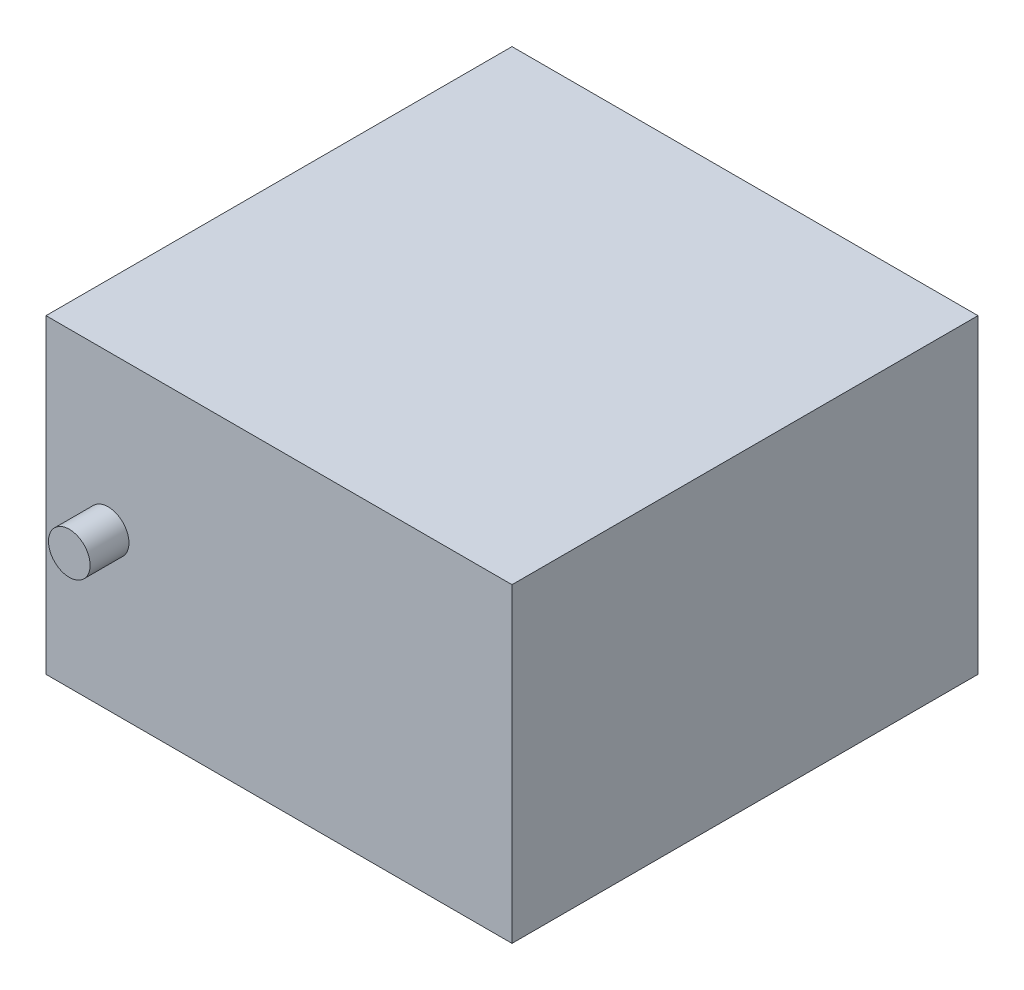
ISO-10303-21;
HEADER;
FILE_DESCRIPTION(('STEP AP214'),'2;1');
FILE_NAME('part.step','',(''),(''),'','','');
FILE_SCHEMA(('AUTOMOTIVE_DESIGN { 1 0 10303 214 1 1 1 1 }'));
ENDSEC;
DATA;
#1=APPLICATION_CONTEXT('core data for automotive mechanical design processes');
#2=APPLICATION_PROTOCOL_DEFINITION('international standard','automotive_design',2000,#1);
#3=PRODUCT_CONTEXT('',#1,'mechanical');
#4=PRODUCT('Part','Part','',(#3));
#5=PRODUCT_RELATED_PRODUCT_CATEGORY('part','',(#4));
#6=PRODUCT_DEFINITION_FORMATION('','',#4);
#7=PRODUCT_DEFINITION_CONTEXT('part definition',#1,'design');
#8=PRODUCT_DEFINITION('design','',#6,#7);
#9=PRODUCT_DEFINITION_SHAPE('','',#8);
#10=(LENGTH_UNIT() NAMED_UNIT(*) SI_UNIT(.MILLI.,.METRE.));
#11=(NAMED_UNIT(*) PLANE_ANGLE_UNIT() SI_UNIT($,.RADIAN.));
#12=(NAMED_UNIT(*) SI_UNIT($,.STERADIAN.) SOLID_ANGLE_UNIT());
#13=UNCERTAINTY_MEASURE_WITH_UNIT(LENGTH_MEASURE(1.E-05),#10,'distance_accuracy_value','');
#14=(GEOMETRIC_REPRESENTATION_CONTEXT(3) GLOBAL_UNCERTAINTY_ASSIGNED_CONTEXT((#13)) GLOBAL_UNIT_ASSIGNED_CONTEXT((#10,
#11,#12)) REPRESENTATION_CONTEXT('',''));
#15=CARTESIAN_POINT('',(0.,0.,0.));
#16=DIRECTION('',(0.,0.,1.));
#17=DIRECTION('',(1.,0.,0.));
#18=AXIS2_PLACEMENT_3D('',#15,#16,#17);
#19=CARTESIAN_POINT('',(-32.3188405797101,20.8695652173913,40.));
#20=DIRECTION('',(1.,0.,0.));
#21=DIRECTION('',(0.,1.,0.));
#22=AXIS2_PLACEMENT_3D('',#19,#20,#21);
#23=PLANE('',#22);
#24=DIRECTION('',(0.,0.,-1.));
#25=VECTOR('',#24,1.);
#26=CARTESIAN_POINT('',(-32.3188405797101,20.8695652173913,40.));
#27=LINE('',#26,#25);
#28=CARTESIAN_POINT('',(-32.3188405797101,20.8695652173913,40.));
#29=VERTEX_POINT('',#28);
#30=CARTESIAN_POINT('',(-32.3188405797101,20.8695652173913,10.));
#31=VERTEX_POINT('',#30);
#32=EDGE_CURVE('E46',#29,#31,#27,.T.);
#33=ORIENTED_EDGE('',*,*,#32,.T.);
#34=DIRECTION('',(0.,-1.,0.));
#35=VECTOR('',#34,1.);
#36=CARTESIAN_POINT('',(-32.3188405797102,20.8695652173913,10.));
#37=LINE('',#36,#35);
#38=CARTESIAN_POINT('',(-32.3188405797102,0.869565217391302,10.));
#39=VERTEX_POINT('',#38);
#40=EDGE_CURVE('E112',#31,#39,#37,.T.);
#41=ORIENTED_EDGE('',*,*,#40,.T.);
#42=DIRECTION('',(0.,0.,-1.));
#43=VECTOR('',#42,1.);
#44=CARTESIAN_POINT('',(-32.3188405797102,0.869565217391302,40.));
#45=LINE('',#44,#43);
#46=CARTESIAN_POINT('',(-32.3188405797102,0.869565217391302,40.));
#47=VERTEX_POINT('',#46);
#48=EDGE_CURVE('E11',#47,#39,#45,.T.);
#49=ORIENTED_EDGE('',*,*,#48,.F.);
#50=DIRECTION('',(0.,-1.,0.));
#51=VECTOR('',#50,1.);
#52=CARTESIAN_POINT('',(-32.3188405797101,20.8695652173913,40.));
#53=LINE('',#52,#51);
#54=EDGE_CURVE('E102',#29,#47,#53,.T.);
#55=ORIENTED_EDGE('',*,*,#54,.F.);
#56=EDGE_LOOP('',(#33,#41,#49,#55));
#57=FACE_BOUND('',#56,.T.);
#58=ADVANCED_FACE('F38',(#57),#23,.F.);
#59=CARTESIAN_POINT('',(-32.3188405797102,0.869565217391302,40.));
#60=DIRECTION('',(0.,1.,0.));
#61=DIRECTION('',(0.,0.,1.));
#62=AXIS2_PLACEMENT_3D('',#59,#60,#61);
#63=PLANE('',#62);
#64=DIRECTION('',(-1.,0.,0.));
#65=VECTOR('',#64,1.);
#66=CARTESIAN_POINT('',(-32.3188405797102,0.869565217391302,10.));
#67=LINE('',#66,#65);
#68=CARTESIAN_POINT('',(-2.31884057971015,0.869565217391302,10.));
#69=VERTEX_POINT('',#68);
#70=EDGE_CURVE('E119',#69,#39,#67,.T.);
#71=ORIENTED_EDGE('',*,*,#70,.F.);
#72=DIRECTION('',(0.,0.,-1.));
#73=VECTOR('',#72,1.);
#74=CARTESIAN_POINT('',(-2.31884057971015,0.869565217391302,40.));
#75=LINE('',#74,#73);
#76=CARTESIAN_POINT('',(-2.31884057971015,0.869565217391302,40.));
#77=VERTEX_POINT('',#76);
#78=EDGE_CURVE('E53',#77,#69,#75,.T.);
#79=ORIENTED_EDGE('',*,*,#78,.F.);
#80=DIRECTION('',(1.,0.,0.));
#81=VECTOR('',#80,1.);
#82=CARTESIAN_POINT('',(-32.3188405797102,0.869565217391302,40.));
#83=LINE('',#82,#81);
#84=EDGE_CURVE('E92',#47,#77,#83,.T.);
#85=ORIENTED_EDGE('',*,*,#84,.F.);
#86=ORIENTED_EDGE('',*,*,#48,.T.);
#87=EDGE_LOOP('',(#71,#79,#85,#86));
#88=FACE_BOUND('',#87,.T.);
#89=ADVANCED_FACE('F131',(#88),#63,.F.);
#90=CARTESIAN_POINT('',(-32.3188405797101,20.8695652173913,40.));
#91=DIRECTION('',(0.,-1.,0.));
#92=DIRECTION('',(0.,0.,-1.));
#93=AXIS2_PLACEMENT_3D('',#90,#91,#92);
#94=PLANE('',#93);
#95=DIRECTION('',(-1.,0.,0.));
#96=VECTOR('',#95,1.);
#97=CARTESIAN_POINT('',(-32.3188405797101,20.8695652173913,40.));
#98=LINE('',#97,#96);
#99=CARTESIAN_POINT('',(-2.31884057971015,20.8695652173913,40.));
#100=VERTEX_POINT('',#99);
#101=EDGE_CURVE('E91',#100,#29,#98,.T.);
#102=ORIENTED_EDGE('',*,*,#101,.F.);
#103=DIRECTION('',(0.,0.,-1.));
#104=VECTOR('',#103,1.);
#105=CARTESIAN_POINT('',(-2.31884057971015,20.8695652173913,40.));
#106=LINE('',#105,#104);
#107=CARTESIAN_POINT('',(-2.31884057971015,20.8695652173913,10.));
#108=VERTEX_POINT('',#107);
#109=EDGE_CURVE('E78',#100,#108,#106,.T.);
#110=ORIENTED_EDGE('',*,*,#109,.T.);
#111=DIRECTION('',(-1.,0.,0.));
#112=VECTOR('',#111,1.);
#113=CARTESIAN_POINT('',(-32.3188405797102,20.8695652173913,10.));
#114=LINE('',#113,#112);
#115=EDGE_CURVE('E61',#108,#31,#114,.T.);
#116=ORIENTED_EDGE('',*,*,#115,.T.);
#117=ORIENTED_EDGE('',*,*,#32,.F.);
#118=EDGE_LOOP('',(#102,#110,#116,#117));
#119=FACE_BOUND('',#118,.T.);
#120=ADVANCED_FACE('F95',(#119),#94,.F.);
#121=CARTESIAN_POINT('',(0.,0.,40.));
#122=DIRECTION('',(0.,0.,1.));
#123=DIRECTION('',(1.,0.,0.));
#124=AXIS2_PLACEMENT_3D('',#121,#122,#123);
#125=PLANE('',#124);
#126=DIRECTION('',(0.,-1.,0.));
#127=VECTOR('',#126,1.);
#128=CARTESIAN_POINT('',(-2.31884057971015,20.8695652173913,40.));
#129=LINE('',#128,#127);
#130=EDGE_CURVE('E81',#100,#77,#129,.T.);
#131=ORIENTED_EDGE('',*,*,#130,.F.);
#132=ORIENTED_EDGE('',*,*,#101,.T.);
#133=ORIENTED_EDGE('',*,*,#54,.T.);
#134=ORIENTED_EDGE('',*,*,#84,.T.);
#135=EDGE_LOOP('',(#131,#132,#133,#134));
#136=FACE_BOUND('',#135,.T.);
#137=CARTESIAN_POINT('',(-28.3188405797101,10.8695652173913,40.));
#138=DIRECTION('',(0.,0.,1.));
#139=DIRECTION('',(1.,0.,0.));
#140=AXIS2_PLACEMENT_3D('',#137,#138,#139);
#141=CIRCLE('',#140,1.34079944288601);
#142=CARTESIAN_POINT('',(-26.9780411368241,10.8695652173913,40.));
#143=VERTEX_POINT('',#142);
#144=EDGE_CURVE('E108',#143,#143,#141,.T.);
#145=ORIENTED_EDGE('',*,*,#144,.F.);
#146=EDGE_LOOP('',(#145));
#147=FACE_BOUND('',#146,.T.);
#148=ADVANCED_FACE('F88',(#136,#147),#125,.T.);
#149=CARTESIAN_POINT('',(-28.3188405797101,10.8695652173913,42.5));
#150=DIRECTION('',(0.,0.,-1.));
#151=DIRECTION('',(-1.,0.,0.));
#152=AXIS2_PLACEMENT_3D('',#149,#150,#151);
#153=CYLINDRICAL_SURFACE('',#152,1.34079944288601);
#154=CARTESIAN_POINT('',(-28.3188405797101,10.8695652173913,42.5));
#155=DIRECTION('',(0.,0.,1.));
#156=DIRECTION('',(1.,0.,0.));
#157=AXIS2_PLACEMENT_3D('',#154,#155,#156);
#158=CIRCLE('',#157,1.34079944288601);
#159=CARTESIAN_POINT('',(-26.9780411368241,10.8695652173913,42.5));
#160=VERTEX_POINT('',#159);
#161=EDGE_CURVE('E107',#160,#160,#158,.T.);
#162=ORIENTED_EDGE('',*,*,#161,.F.);
#163=EDGE_LOOP('',(#162));
#164=FACE_BOUND('',#163,.T.);
#165=ORIENTED_EDGE('',*,*,#144,.T.);
#166=EDGE_LOOP('',(#165));
#167=FACE_BOUND('',#166,.T.);
#168=ADVANCED_FACE('F145',(#164,#167),#153,.T.);
#169=CARTESIAN_POINT('',(-28.3188405797101,10.8695652173913,42.5));
#170=DIRECTION('',(0.,0.,1.));
#171=DIRECTION('',(1.,0.,0.));
#172=AXIS2_PLACEMENT_3D('',#169,#170,#171);
#173=PLANE('',#172);
#174=ORIENTED_EDGE('',*,*,#161,.T.);
#175=EDGE_LOOP('',(#174));
#176=FACE_BOUND('',#175,.T.);
#177=ADVANCED_FACE('F148',(#176),#173,.T.);
#178=CARTESIAN_POINT('',(-32.3188405797102,20.8695652173913,10.));
#179=DIRECTION('',(0.,0.,1.));
#180=DIRECTION('',(1.,0.,0.));
#181=AXIS2_PLACEMENT_3D('',#178,#179,#180);
#182=PLANE('',#181);
#183=ORIENTED_EDGE('',*,*,#115,.F.);
#184=DIRECTION('',(0.,-1.,0.));
#185=VECTOR('',#184,1.);
#186=CARTESIAN_POINT('',(-2.31884057971015,20.8695652173913,10.));
#187=LINE('',#186,#185);
#188=EDGE_CURVE('E82',#108,#69,#187,.T.);
#189=ORIENTED_EDGE('',*,*,#188,.T.);
#190=ORIENTED_EDGE('',*,*,#70,.T.);
#191=ORIENTED_EDGE('',*,*,#40,.F.);
#192=EDGE_LOOP('',(#183,#189,#190,#191));
#193=FACE_BOUND('',#192,.T.);
#194=ADVANCED_FACE('F129',(#193),#182,.F.);
#195=CARTESIAN_POINT('',(-2.31884057971015,20.8695652173913,40.));
#196=DIRECTION('',(-1.,0.,0.));
#197=DIRECTION('',(0.,0.,1.));
#198=AXIS2_PLACEMENT_3D('',#195,#196,#197);
#199=PLANE('',#198);
#200=ORIENTED_EDGE('',*,*,#78,.T.);
#201=ORIENTED_EDGE('',*,*,#188,.F.);
#202=ORIENTED_EDGE('',*,*,#109,.F.);
#203=ORIENTED_EDGE('',*,*,#130,.T.);
#204=EDGE_LOOP('',(#200,#201,#202,#203));
#205=FACE_BOUND('',#204,.T.);
#206=ADVANCED_FACE('F80',(#205),#199,.F.);
#207=CLOSED_SHELL('',(#58,#89,#120,#148,#168,#177,#194,#206));
#208=MANIFOLD_SOLID_BREP('B2',#207);
#209=ADVANCED_BREP_SHAPE_REPRESENTATION('',(#18,#208),#14);
#210=SHAPE_DEFINITION_REPRESENTATION(#9,#209);
ENDSEC;
END-ISO-10303-21;
